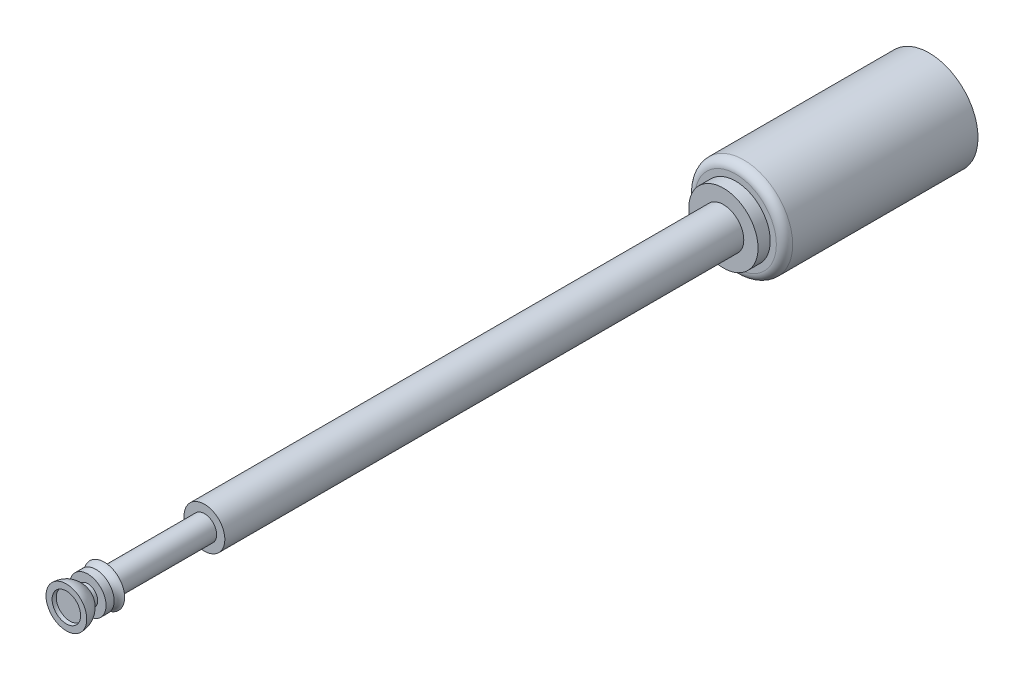
ISO-10303-21;
HEADER;
FILE_DESCRIPTION(('STEP AP214'),'2;1');
FILE_NAME('part.step','',(''),(''),'','','');
FILE_SCHEMA(('AUTOMOTIVE_DESIGN { 1 0 10303 214 1 1 1 1 }'));
ENDSEC;
DATA;
#1=APPLICATION_CONTEXT('core data for automotive mechanical design processes');
#2=APPLICATION_PROTOCOL_DEFINITION('international standard','automotive_design',2000,#1);
#3=PRODUCT_CONTEXT('',#1,'mechanical');
#4=PRODUCT('Part','Part','',(#3));
#5=PRODUCT_RELATED_PRODUCT_CATEGORY('part','',(#4));
#6=PRODUCT_DEFINITION_FORMATION('','',#4);
#7=PRODUCT_DEFINITION_CONTEXT('part definition',#1,'design');
#8=PRODUCT_DEFINITION('design','',#6,#7);
#9=PRODUCT_DEFINITION_SHAPE('','',#8);
#10=(LENGTH_UNIT() NAMED_UNIT(*) SI_UNIT(.MILLI.,.METRE.));
#11=(NAMED_UNIT(*) PLANE_ANGLE_UNIT() SI_UNIT($,.RADIAN.));
#12=(NAMED_UNIT(*) SI_UNIT($,.STERADIAN.) SOLID_ANGLE_UNIT());
#13=UNCERTAINTY_MEASURE_WITH_UNIT(LENGTH_MEASURE(1.E-05),#10,'distance_accuracy_value','');
#14=(GEOMETRIC_REPRESENTATION_CONTEXT(3) GLOBAL_UNCERTAINTY_ASSIGNED_CONTEXT((#13)) GLOBAL_UNIT_ASSIGNED_CONTEXT((#10,
#11,#12)) REPRESENTATION_CONTEXT('',''));
#15=CARTESIAN_POINT('',(0.,0.,0.));
#16=DIRECTION('',(0.,0.,1.));
#17=DIRECTION('',(1.,0.,0.));
#18=AXIS2_PLACEMENT_3D('',#15,#16,#17);
#19=CARTESIAN_POINT('',(0.,0.,16.43));
#20=DIRECTION('',(0.,0.,-1.));
#21=DIRECTION('',(1.,0.,0.));
#22=AXIS2_PLACEMENT_3D('',#19,#20,#21);
#23=SPHERICAL_SURFACE('',#22,0.35);
#24=CARTESIAN_POINT('',(0.,0.,16.34));
#25=DIRECTION('',(0.,0.,1.));
#26=DIRECTION('',(1.,0.,0.));
#27=AXIS2_PLACEMENT_3D('',#24,#25,#26);
#28=CIRCLE('',#27,0.338230690505755);
#29=CARTESIAN_POINT('',(0.338230690505755,0.,16.34));
#30=VERTEX_POINT('',#29);
#31=EDGE_CURVE('E59',#30,#30,#28,.F.);
#32=ORIENTED_EDGE('',*,*,#31,.T.);
#33=EDGE_LOOP('',(#32));
#34=FACE_BOUND('',#33,.T.);
#35=CARTESIAN_POINT('',(0.,0.,16.43));
#36=DIRECTION('',(0.,0.,-1.));
#37=DIRECTION('',(-1.,0.,0.));
#38=AXIS2_PLACEMENT_3D('',#35,#36,#37);
#39=CIRCLE('',#38,0.35);
#40=CARTESIAN_POINT('',(-0.35,0.,16.43));
#41=VERTEX_POINT('',#40);
#42=EDGE_CURVE('E61',#41,#41,#39,.T.);
#43=ORIENTED_EDGE('',*,*,#42,.F.);
#44=EDGE_LOOP('',(#43));
#45=FACE_BOUND('',#44,.T.);
#46=ADVANCED_FACE('F39',(#34,#45),#23,.F.);
#47=CARTESIAN_POINT('',(0.,0.,15.7058962444913));
#48=DIRECTION('',(0.,0.,-1.));
#49=DIRECTION('',(-1.,0.,0.));
#50=AXIS2_PLACEMENT_3D('',#47,#48,#49);
#51=TOROIDAL_SURFACE('',#50,0.597095035047052,0.227641624766632);
#52=CARTESIAN_POINT('',(0.,0.,15.5));
#53=DIRECTION('',(0.,0.,-1.));
#54=DIRECTION('',(-1.,0.,0.));
#55=AXIS2_PLACEMENT_3D('',#52,#53,#54);
#56=CIRCLE('',#55,0.5);
#57=CARTESIAN_POINT('',(-0.5,0.,15.5));
#58=VERTEX_POINT('',#57);
#59=EDGE_CURVE('E73',#58,#58,#56,.F.);
#60=ORIENTED_EDGE('',*,*,#59,.T.);
#61=EDGE_LOOP('',(#60));
#62=FACE_BOUND('',#61,.T.);
#63=CARTESIAN_POINT('',(0.,0.,15.7058962444913));
#64=DIRECTION('',(0.,0.,-1.));
#65=DIRECTION('',(-1.,0.,0.));
#66=AXIS2_PLACEMENT_3D('',#63,#64,#65);
#67=CIRCLE('',#66,0.36945341028042);
#68=CARTESIAN_POINT('',(-0.36945341028042,0.,15.7058962444913));
#69=VERTEX_POINT('',#68);
#70=EDGE_CURVE('E87',#69,#69,#67,.T.);
#71=ORIENTED_EDGE('',*,*,#70,.T.);
#72=EDGE_LOOP('',(#71));
#73=FACE_BOUND('',#72,.T.);
#74=ADVANCED_FACE('F123',(#62,#73),#51,.F.);
#75=CARTESIAN_POINT('',(0.447644951414475,0.,15.7058962444913));
#76=DIRECTION('',(0.,0.,1.));
#77=DIRECTION('',(1.,0.,0.));
#78=AXIS2_PLACEMENT_3D('',#75,#76,#77);
#79=PLANE('',#78);
#80=ORIENTED_EDGE('',*,*,#70,.F.);
#81=EDGE_LOOP('',(#80));
#82=FACE_BOUND('',#81,.T.);
#83=CARTESIAN_POINT('',(0.,0.,15.7058962444913));
#84=DIRECTION('',(0.,0.,-1.));
#85=DIRECTION('',(-1.,0.,0.));
#86=AXIS2_PLACEMENT_3D('',#83,#84,#85);
#87=CIRCLE('',#86,0.447644951414475);
#88=CARTESIAN_POINT('',(-0.447644951414475,0.,15.7058962444913));
#89=VERTEX_POINT('',#88);
#90=EDGE_CURVE('E84',#89,#89,#87,.T.);
#91=ORIENTED_EDGE('',*,*,#90,.T.);
#92=EDGE_LOOP('',(#91));
#93=FACE_BOUND('',#92,.T.);
#94=ADVANCED_FACE('F129',(#82,#93),#79,.F.);
#95=CARTESIAN_POINT('',(0.,0.,15.5));
#96=DIRECTION('',(0.,0.,-1.));
#97=DIRECTION('',(-1.,0.,0.));
#98=AXIS2_PLACEMENT_3D('',#95,#96,#97);
#99=CYLINDRICAL_SURFACE('',#98,0.447644951414475);
#100=ORIENTED_EDGE('',*,*,#90,.F.);
#101=EDGE_LOOP('',(#100));
#102=FACE_BOUND('',#101,.T.);
#103=CARTESIAN_POINT('',(0.,0.,15.9033422721535));
#104=DIRECTION('',(0.,0.,-1.));
#105=DIRECTION('',(-1.,0.,0.));
#106=AXIS2_PLACEMENT_3D('',#103,#104,#105);
#107=CIRCLE('',#106,0.447644951414475);
#108=CARTESIAN_POINT('',(-0.447644951414475,0.,15.9033422721535));
#109=VERTEX_POINT('',#108);
#110=EDGE_CURVE('E81',#109,#109,#107,.T.);
#111=ORIENTED_EDGE('',*,*,#110,.T.);
#112=EDGE_LOOP('',(#111));
#113=FACE_BOUND('',#112,.T.);
#114=ADVANCED_FACE('F178',(#102,#113),#99,.T.);
#115=CARTESIAN_POINT('',(0.243036734149381,0.,15.9033422721535));
#116=DIRECTION('',(0.,0.,-1.));
#117=DIRECTION('',(-1.,0.,0.));
#118=AXIS2_PLACEMENT_3D('',#115,#116,#117);
#119=PLANE('',#118);
#120=ORIENTED_EDGE('',*,*,#110,.F.);
#121=EDGE_LOOP('',(#120));
#122=FACE_BOUND('',#121,.T.);
#123=CARTESIAN_POINT('',(0.,0.,15.9033422721535));
#124=DIRECTION('',(0.,0.,-1.));
#125=DIRECTION('',(-1.,0.,0.));
#126=AXIS2_PLACEMENT_3D('',#123,#124,#125);
#127=CIRCLE('',#126,0.243036734149381);
#128=CARTESIAN_POINT('',(-0.243036734149381,0.,15.9033422721535));
#129=VERTEX_POINT('',#128);
#130=EDGE_CURVE('E78',#129,#129,#127,.T.);
#131=ORIENTED_EDGE('',*,*,#130,.T.);
#132=EDGE_LOOP('',(#131));
#133=FACE_BOUND('',#132,.T.);
#134=ADVANCED_FACE('F174',(#122,#133),#119,.F.);
#135=CARTESIAN_POINT('',(0.,0.,15.5));
#136=DIRECTION('',(0.,0.,-1.));
#137=DIRECTION('',(-1.,0.,0.));
#138=AXIS2_PLACEMENT_3D('',#135,#136,#137);
#139=CYLINDRICAL_SURFACE('',#138,0.243036734149381);
#140=ORIENTED_EDGE('',*,*,#130,.F.);
#141=EDGE_LOOP('',(#140));
#142=FACE_BOUND('',#141,.T.);
#143=CARTESIAN_POINT('',(0.,0.,15.993041024976));
#144=DIRECTION('',(0.,0.,-1.));
#145=DIRECTION('',(-1.,0.,0.));
#146=AXIS2_PLACEMENT_3D('',#143,#144,#145);
#147=CIRCLE('',#146,0.243036734149381);
#148=CARTESIAN_POINT('',(-0.243036734149381,0.,15.993041024976));
#149=VERTEX_POINT('',#148);
#150=EDGE_CURVE('E70',#149,#149,#147,.T.);
#151=ORIENTED_EDGE('',*,*,#150,.T.);
#152=EDGE_LOOP('',(#151));
#153=FACE_BOUND('',#152,.T.);
#154=ADVANCED_FACE('F167',(#142,#153),#139,.T.);
#155=CARTESIAN_POINT('',(0.,0.,16.43));
#156=DIRECTION('',(0.,0.,-1.));
#157=DIRECTION('',(1.,0.,0.));
#158=AXIS2_PLACEMENT_3D('',#155,#156,#157);
#159=SPHERICAL_SURFACE('',#158,0.5);
#160=ORIENTED_EDGE('',*,*,#150,.F.);
#161=EDGE_LOOP('',(#160));
#162=FACE_BOUND('',#161,.T.);
#163=CARTESIAN_POINT('',(0.,0.,16.43));
#164=DIRECTION('',(0.,0.,-1.));
#165=DIRECTION('',(-1.,0.,0.));
#166=AXIS2_PLACEMENT_3D('',#163,#164,#165);
#167=CIRCLE('',#166,0.5);
#168=CARTESIAN_POINT('',(-0.5,0.,16.43));
#169=VERTEX_POINT('',#168);
#170=EDGE_CURVE('E65',#169,#169,#167,.T.);
#171=ORIENTED_EDGE('',*,*,#170,.T.);
#172=EDGE_LOOP('',(#171));
#173=FACE_BOUND('',#172,.T.);
#174=ADVANCED_FACE('F162',(#162,#173),#159,.T.);
#175=CARTESIAN_POINT('',(0.35,0.,16.43));
#176=DIRECTION('',(0.,0.,-1.));
#177=DIRECTION('',(-1.,0.,0.));
#178=AXIS2_PLACEMENT_3D('',#175,#176,#177);
#179=PLANE('',#178);
#180=ORIENTED_EDGE('',*,*,#170,.F.);
#181=EDGE_LOOP('',(#180));
#182=FACE_BOUND('',#181,.T.);
#183=ORIENTED_EDGE('',*,*,#42,.T.);
#184=EDGE_LOOP('',(#183));
#185=FACE_BOUND('',#184,.T.);
#186=ADVANCED_FACE('F154',(#182,#185),#179,.F.);
#187=CARTESIAN_POINT('',(0.,0.,16.34));
#188=DIRECTION('',(0.,0.,1.));
#189=DIRECTION('',(1.,0.,0.));
#190=AXIS2_PLACEMENT_3D('',#187,#188,#189);
#191=PLANE('',#190);
#192=ORIENTED_EDGE('',*,*,#31,.F.);
#193=EDGE_LOOP('',(#192));
#194=FACE_BOUND('',#193,.T.);
#195=ADVANCED_FACE('F151',(#194),#191,.T.);
#196=CARTESIAN_POINT('',(-0.3,0.,13.04));
#197=DIRECTION('',(0.,0.,-1.));
#198=DIRECTION('',(-1.,0.,0.));
#199=AXIS2_PLACEMENT_3D('',#196,#197,#198);
#200=PLANE('',#199);
#201=CARTESIAN_POINT('',(0.,0.,13.04));
#202=DIRECTION('',(0.,0.,-1.));
#203=DIRECTION('',(-1.,0.,0.));
#204=AXIS2_PLACEMENT_3D('',#201,#202,#203);
#205=CIRCLE('',#204,0.3);
#206=CARTESIAN_POINT('',(-0.3,0.,13.04));
#207=VERTEX_POINT('',#206);
#208=EDGE_CURVE('E202',#207,#207,#205,.T.);
#209=ORIENTED_EDGE('',*,*,#208,.T.);
#210=EDGE_LOOP('',(#209));
#211=FACE_BOUND('',#210,.T.);
#212=CARTESIAN_POINT('',(0.,0.,13.04));
#213=DIRECTION('',(0.,0.,-1.));
#214=DIRECTION('',(-1.,0.,0.));
#215=AXIS2_PLACEMENT_3D('',#212,#213,#214);
#216=CIRCLE('',#215,0.5);
#217=CARTESIAN_POINT('',(-0.5,0.,13.04));
#218=VERTEX_POINT('',#217);
#219=EDGE_CURVE('E43',#218,#218,#216,.T.);
#220=ORIENTED_EDGE('',*,*,#219,.F.);
#221=EDGE_LOOP('',(#220));
#222=FACE_BOUND('',#221,.T.);
#223=ADVANCED_FACE('F153',(#211,#222),#200,.F.);
#224=CARTESIAN_POINT('',(-0.3,0.,15.5));
#225=DIRECTION('',(0.,0.,1.));
#226=DIRECTION('',(1.,0.,0.));
#227=AXIS2_PLACEMENT_3D('',#224,#225,#226);
#228=PLANE('',#227);
#229=CARTESIAN_POINT('',(0.,0.,15.5));
#230=DIRECTION('',(0.,0.,-1.));
#231=DIRECTION('',(-1.,0.,0.));
#232=AXIS2_PLACEMENT_3D('',#229,#230,#231);
#233=CIRCLE('',#232,0.3);
#234=CARTESIAN_POINT('',(-0.3,0.,15.5));
#235=VERTEX_POINT('',#234);
#236=EDGE_CURVE('E205',#235,#235,#233,.T.);
#237=ORIENTED_EDGE('',*,*,#236,.F.);
#238=EDGE_LOOP('',(#237));
#239=FACE_BOUND('',#238,.T.);
#240=ORIENTED_EDGE('',*,*,#59,.F.);
#241=EDGE_LOOP('',(#240));
#242=FACE_BOUND('',#241,.T.);
#243=ADVANCED_FACE('F160',(#239,#242),#228,.F.);
#244=CARTESIAN_POINT('',(0.,0.,15.5));
#245=DIRECTION('',(0.,0.,-1.));
#246=DIRECTION('',(-1.,0.,0.));
#247=AXIS2_PLACEMENT_3D('',#244,#245,#246);
#248=CYLINDRICAL_SURFACE('',#247,0.3);
#249=ORIENTED_EDGE('',*,*,#208,.F.);
#250=EDGE_LOOP('',(#249));
#251=FACE_BOUND('',#250,.T.);
#252=ORIENTED_EDGE('',*,*,#236,.T.);
#253=EDGE_LOOP('',(#252));
#254=FACE_BOUND('',#253,.T.);
#255=ADVANCED_FACE('F149',(#251,#254),#248,.T.);
#256=CARTESIAN_POINT('',(0.,0.,-4.75));
#257=DIRECTION('',(0.,0.,1.));
#258=DIRECTION('',(1.,0.,0.));
#259=AXIS2_PLACEMENT_3D('',#256,#257,#258);
#260=PLANE('',#259);
#261=CARTESIAN_POINT('',(0.,0.,-4.75));
#262=DIRECTION('',(0.,0.,1.));
#263=DIRECTION('',(1.,0.,0.));
#264=AXIS2_PLACEMENT_3D('',#261,#262,#263);
#265=CIRCLE('',#264,1.2);
#266=CARTESIAN_POINT('',(1.2,0.,-4.75));
#267=VERTEX_POINT('',#266);
#268=EDGE_CURVE('E90',#267,#267,#265,.T.);
#269=ORIENTED_EDGE('',*,*,#268,.F.);
#270=EDGE_LOOP('',(#269));
#271=FACE_BOUND('',#270,.T.);
#272=ADVANCED_FACE('F117',(#271),#260,.F.);
#273=CARTESIAN_POINT('',(0.,0.,-4.75));
#274=DIRECTION('',(0.,0.,1.));
#275=DIRECTION('',(1.,0.,0.));
#276=AXIS2_PLACEMENT_3D('',#273,#274,#275);
#277=CYLINDRICAL_SURFACE('',#276,1.2);
#278=CARTESIAN_POINT('',(0.,0.,-0.2));
#279=DIRECTION('',(0.,0.,1.));
#280=DIRECTION('',(1.,0.,0.));
#281=AXIS2_PLACEMENT_3D('',#278,#279,#280);
#282=CIRCLE('',#281,1.2);
#283=CARTESIAN_POINT('',(1.2,0.,-0.2));
#284=VERTEX_POINT('',#283);
#285=EDGE_CURVE('E96',#284,#284,#282,.F.);
#286=ORIENTED_EDGE('',*,*,#285,.T.);
#287=EDGE_LOOP('',(#286));
#288=FACE_BOUND('',#287,.T.);
#289=ORIENTED_EDGE('',*,*,#268,.T.);
#290=EDGE_LOOP('',(#289));
#291=FACE_BOUND('',#290,.T.);
#292=ADVANCED_FACE('F111',(#288,#291),#277,.T.);
#293=CARTESIAN_POINT('',(0.,0.,-0.2));
#294=DIRECTION('',(0.,0.,1.));
#295=DIRECTION('',(1.,0.,0.));
#296=AXIS2_PLACEMENT_3D('',#293,#294,#295);
#297=TOROIDAL_SURFACE('',#296,1.,0.2);
#298=ORIENTED_EDGE('',*,*,#285,.F.);
#299=EDGE_LOOP('',(#298));
#300=FACE_BOUND('',#299,.T.);
#301=CARTESIAN_POINT('',(0.,0.,0.));
#302=DIRECTION('',(0.,0.,1.));
#303=DIRECTION('',(1.,0.,0.));
#304=AXIS2_PLACEMENT_3D('',#301,#302,#303);
#305=CIRCLE('',#304,1.);
#306=CARTESIAN_POINT('',(1.,0.,0.));
#307=VERTEX_POINT('',#306);
#308=EDGE_CURVE('E93',#307,#307,#305,.T.);
#309=ORIENTED_EDGE('',*,*,#308,.F.);
#310=EDGE_LOOP('',(#309));
#311=FACE_BOUND('',#310,.T.);
#312=ADVANCED_FACE('F106',(#300,#311),#297,.T.);
#313=CARTESIAN_POINT('',(0.,0.,0.));
#314=DIRECTION('',(0.,0.,1.));
#315=DIRECTION('',(1.,0.,0.));
#316=AXIS2_PLACEMENT_3D('',#313,#314,#315);
#317=PLANE('',#316);
#318=CARTESIAN_POINT('',(0.,0.,0.));
#319=DIRECTION('',(0.,0.,1.));
#320=DIRECTION('',(1.,0.,0.));
#321=AXIS2_PLACEMENT_3D('',#318,#319,#320);
#322=CIRCLE('',#321,0.85);
#323=CARTESIAN_POINT('',(0.85,0.,0.));
#324=VERTEX_POINT('',#323);
#325=EDGE_CURVE('E53',#324,#324,#322,.T.);
#326=ORIENTED_EDGE('',*,*,#325,.F.);
#327=EDGE_LOOP('',(#326));
#328=FACE_BOUND('',#327,.T.);
#329=ORIENTED_EDGE('',*,*,#308,.T.);
#330=EDGE_LOOP('',(#329));
#331=FACE_BOUND('',#330,.T.);
#332=ADVANCED_FACE('F103',(#328,#331),#317,.T.);
#333=CARTESIAN_POINT('',(0.,0.,0.3));
#334=DIRECTION('',(0.,0.,-1.));
#335=DIRECTION('',(-1.,0.,0.));
#336=AXIS2_PLACEMENT_3D('',#333,#334,#335);
#337=CYLINDRICAL_SURFACE('',#336,0.85);
#338=CARTESIAN_POINT('',(0.,0.,0.3));
#339=DIRECTION('',(0.,0.,1.));
#340=DIRECTION('',(1.,0.,0.));
#341=AXIS2_PLACEMENT_3D('',#338,#339,#340);
#342=CIRCLE('',#341,0.85);
#343=CARTESIAN_POINT('',(0.85,0.,0.3));
#344=VERTEX_POINT('',#343);
#345=EDGE_CURVE('E48',#344,#344,#342,.T.);
#346=ORIENTED_EDGE('',*,*,#345,.F.);
#347=EDGE_LOOP('',(#346));
#348=FACE_BOUND('',#347,.T.);
#349=ORIENTED_EDGE('',*,*,#325,.T.);
#350=EDGE_LOOP('',(#349));
#351=FACE_BOUND('',#350,.T.);
#352=ADVANCED_FACE('F101',(#348,#351),#337,.T.);
#353=CARTESIAN_POINT('',(0.,0.,0.3));
#354=DIRECTION('',(0.,0.,1.));
#355=DIRECTION('',(1.,0.,0.));
#356=AXIS2_PLACEMENT_3D('',#353,#354,#355);
#357=PLANE('',#356);
#358=CARTESIAN_POINT('',(0.,0.,0.3));
#359=DIRECTION('',(0.,0.,1.));
#360=DIRECTION('',(1.,0.,0.));
#361=AXIS2_PLACEMENT_3D('',#358,#359,#360);
#362=CIRCLE('',#361,0.5);
#363=CARTESIAN_POINT('',(0.5,0.,0.3));
#364=VERTEX_POINT('',#363);
#365=EDGE_CURVE('E11',#364,#364,#362,.T.);
#366=ORIENTED_EDGE('',*,*,#365,.F.);
#367=EDGE_LOOP('',(#366));
#368=FACE_BOUND('',#367,.T.);
#369=ORIENTED_EDGE('',*,*,#345,.T.);
#370=EDGE_LOOP('',(#369));
#371=FACE_BOUND('',#370,.T.);
#372=ADVANCED_FACE('F213',(#368,#371),#357,.T.);
#373=CARTESIAN_POINT('',(0.,0.,15.5));
#374=DIRECTION('',(0.,0.,-1.));
#375=DIRECTION('',(-1.,0.,0.));
#376=AXIS2_PLACEMENT_3D('',#373,#374,#375);
#377=CYLINDRICAL_SURFACE('',#376,0.5);
#378=ORIENTED_EDGE('',*,*,#219,.T.);
#379=EDGE_LOOP('',(#378));
#380=FACE_BOUND('',#379,.T.);
#381=ORIENTED_EDGE('',*,*,#365,.T.);
#382=EDGE_LOOP('',(#381));
#383=FACE_BOUND('',#382,.T.);
#384=ADVANCED_FACE('F41',(#380,#383),#377,.T.);
#385=CLOSED_SHELL('',(#46,#74,#94,#114,#134,#154,#174,#186,#195,#223,#243,#255,#272,#292,#312,
#332,#352,#372,#384));
#386=CARTESIAN_POINT('',(0.,0.,16.2946558305331));
#387=DIRECTION('',(0.,0.,-1.));
#388=DIRECTION('',(-1.,0.,0.));
#389=AXIS2_PLACEMENT_3D('',#386,#387,#388);
#390=CIRCLE('',#389,0.322772297124937);
#391=CARTESIAN_POINT('',(-0.322772297124937,0.,16.2946558305331));
#392=VERTEX_POINT('',#391);
#393=EDGE_CURVE('E57',#392,#392,#390,.F.);
#394=ORIENTED_EDGE('',*,*,#393,.T.);
#395=EDGE_LOOP('',(#394));
#396=FACE_BOUND('',#395,.T.);
#397=ADVANCED_FACE('F125',(#396),#23,.F.);
#398=CARTESIAN_POINT('',(0.,0.,16.2946558305331));
#399=DIRECTION('',(0.,0.,-1.));
#400=DIRECTION('',(-1.,0.,0.));
#401=AXIS2_PLACEMENT_3D('',#398,#399,#400);
#402=PLANE('',#401);
#403=ORIENTED_EDGE('',*,*,#393,.F.);
#404=EDGE_LOOP('',(#403));
#405=FACE_BOUND('',#404,.T.);
#406=ADVANCED_FACE('F136',(#405),#402,.T.);
#407=CLOSED_SHELL('',(#397,#406));
#408=ORIENTED_CLOSED_SHELL('',*,#407,.T.);
#409=BREP_WITH_VOIDS('B2',#385,(#408));
#410=ADVANCED_BREP_SHAPE_REPRESENTATION('',(#18,#409),#14);
#411=SHAPE_DEFINITION_REPRESENTATION(#9,#410);
ENDSEC;
END-ISO-10303-21;
